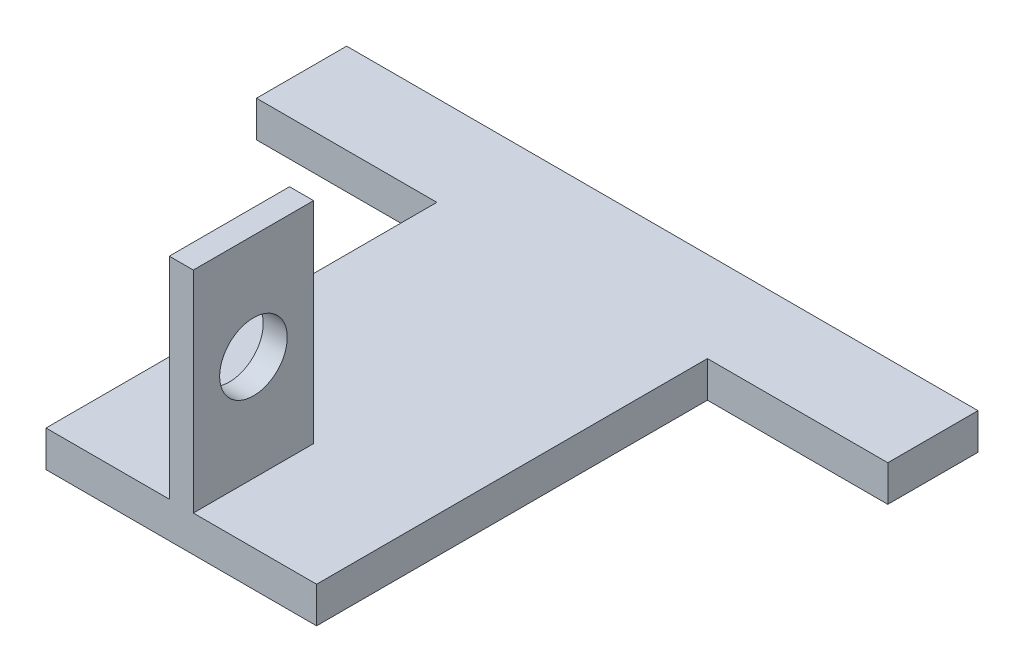
ISO-10303-21;
HEADER;
FILE_DESCRIPTION(('STEP AP214'),'2;1');
FILE_NAME('part.step','',(''),(''),'','','');
FILE_SCHEMA(('AUTOMOTIVE_DESIGN { 1 0 10303 214 1 1 1 1 }'));
ENDSEC;
DATA;
#1=APPLICATION_CONTEXT('core data for automotive mechanical design processes');
#2=APPLICATION_PROTOCOL_DEFINITION('international standard','automotive_design',2000,#1);
#3=PRODUCT_CONTEXT('',#1,'mechanical');
#4=PRODUCT('Part','Part','',(#3));
#5=PRODUCT_RELATED_PRODUCT_CATEGORY('part','',(#4));
#6=PRODUCT_DEFINITION_FORMATION('','',#4);
#7=PRODUCT_DEFINITION_CONTEXT('part definition',#1,'design');
#8=PRODUCT_DEFINITION('design','',#6,#7);
#9=PRODUCT_DEFINITION_SHAPE('','',#8);
#10=(LENGTH_UNIT() NAMED_UNIT(*) SI_UNIT(.MILLI.,.METRE.));
#11=(NAMED_UNIT(*) PLANE_ANGLE_UNIT() SI_UNIT($,.RADIAN.));
#12=(NAMED_UNIT(*) SI_UNIT($,.STERADIAN.) SOLID_ANGLE_UNIT());
#13=UNCERTAINTY_MEASURE_WITH_UNIT(LENGTH_MEASURE(1.E-05),#10,'distance_accuracy_value','');
#14=(GEOMETRIC_REPRESENTATION_CONTEXT(3) GLOBAL_UNCERTAINTY_ASSIGNED_CONTEXT((#13)) GLOBAL_UNIT_ASSIGNED_CONTEXT((#10,
#11,#12)) REPRESENTATION_CONTEXT('',''));
#15=CARTESIAN_POINT('',(0.,0.,0.));
#16=DIRECTION('',(0.,0.,1.));
#17=DIRECTION('',(1.,0.,0.));
#18=AXIS2_PLACEMENT_3D('',#15,#16,#17);
#19=CARTESIAN_POINT('',(0.,2.4,16.));
#20=DIRECTION('',(0.,0.,-1.));
#21=DIRECTION('',(-1.,0.,0.));
#22=AXIS2_PLACEMENT_3D('',#19,#20,#21);
#23=PLANE('',#22);
#24=DIRECTION('',(1.,0.,0.));
#25=VECTOR('',#24,1.);
#26=CARTESIAN_POINT('',(0.,0.,16.));
#27=LINE('',#26,#25);
#28=CARTESIAN_POINT('',(-9.,0.,16.));
#29=VERTEX_POINT('',#28);
#30=CARTESIAN_POINT('',(9.,0.,16.));
#31=VERTEX_POINT('',#30);
#32=EDGE_CURVE('E141',#29,#31,#27,.T.);
#33=ORIENTED_EDGE('',*,*,#32,.T.);
#34=DIRECTION('',(0.,-1.,0.));
#35=VECTOR('',#34,1.);
#36=CARTESIAN_POINT('',(9.,2.4,16.));
#37=LINE('',#36,#35);
#38=CARTESIAN_POINT('',(9.,2.4,16.));
#39=VERTEX_POINT('',#38);
#40=EDGE_CURVE('E11',#39,#31,#37,.T.);
#41=ORIENTED_EDGE('',*,*,#40,.F.);
#42=DIRECTION('',(1.,0.,0.));
#43=VECTOR('',#42,1.);
#44=CARTESIAN_POINT('',(0.,2.4,16.));
#45=LINE('',#44,#43);
#46=CARTESIAN_POINT('',(0.800000000000002,2.4,16.));
#47=VERTEX_POINT('',#46);
#48=EDGE_CURVE('E153',#47,#39,#45,.T.);
#49=ORIENTED_EDGE('',*,*,#48,.F.);
#50=DIRECTION('',(0.,-1.,0.));
#51=VECTOR('',#50,1.);
#52=CARTESIAN_POINT('',(0.800000000000002,16.4,16.));
#53=LINE('',#52,#51);
#54=CARTESIAN_POINT('',(0.800000000000002,16.4,16.));
#55=VERTEX_POINT('',#54);
#56=EDGE_CURVE('E245',#55,#47,#53,.T.);
#57=ORIENTED_EDGE('',*,*,#56,.F.);
#58=DIRECTION('',(1.,0.,0.));
#59=VECTOR('',#58,1.);
#60=CARTESIAN_POINT('',(-0.799999999999998,16.4,16.));
#61=LINE('',#60,#59);
#62=CARTESIAN_POINT('',(-0.799999999999998,16.4,16.));
#63=VERTEX_POINT('',#62);
#64=EDGE_CURVE('E134',#63,#55,#61,.T.);
#65=ORIENTED_EDGE('',*,*,#64,.F.);
#66=DIRECTION('',(0.,-1.,0.));
#67=VECTOR('',#66,1.);
#68=CARTESIAN_POINT('',(-0.799999999999998,16.4,16.));
#69=LINE('',#68,#67);
#70=CARTESIAN_POINT('',(-0.799999999999999,2.4,16.));
#71=VERTEX_POINT('',#70);
#72=EDGE_CURVE('E146',#63,#71,#69,.T.);
#73=ORIENTED_EDGE('',*,*,#72,.T.);
#74=CARTESIAN_POINT('',(-9.,2.4,16.));
#75=VERTEX_POINT('',#74);
#76=EDGE_CURVE('E150',#75,#71,#45,.T.);
#77=ORIENTED_EDGE('',*,*,#76,.F.);
#78=DIRECTION('',(0.,-1.,0.));
#79=VECTOR('',#78,1.);
#80=CARTESIAN_POINT('',(-9.,2.4,16.));
#81=LINE('',#80,#79);
#82=EDGE_CURVE('E170',#75,#29,#81,.T.);
#83=ORIENTED_EDGE('',*,*,#82,.T.);
#84=EDGE_LOOP('',(#33,#41,#49,#57,#65,#73,#77,#83));
#85=FACE_BOUND('',#84,.T.);
#86=ADVANCED_FACE('F33',(#85),#23,.F.);
#87=CARTESIAN_POINT('',(9.,2.4,0.));
#88=DIRECTION('',(-1.,0.,0.));
#89=DIRECTION('',(0.,0.,1.));
#90=AXIS2_PLACEMENT_3D('',#87,#88,#89);
#91=PLANE('',#90);
#92=DIRECTION('',(0.,0.,-1.));
#93=VECTOR('',#92,1.);
#94=CARTESIAN_POINT('',(9.,0.,0.));
#95=LINE('',#94,#93);
#96=CARTESIAN_POINT('',(9.,0.,-10.));
#97=VERTEX_POINT('',#96);
#98=EDGE_CURVE('E144',#31,#97,#95,.T.);
#99=ORIENTED_EDGE('',*,*,#98,.T.);
#100=DIRECTION('',(0.,-1.,0.));
#101=VECTOR('',#100,1.);
#102=CARTESIAN_POINT('',(9.,2.4,-10.));
#103=LINE('',#102,#101);
#104=CARTESIAN_POINT('',(9.,2.4,-10.));
#105=VERTEX_POINT('',#104);
#106=EDGE_CURVE('E40',#105,#97,#103,.T.);
#107=ORIENTED_EDGE('',*,*,#106,.F.);
#108=DIRECTION('',(0.,0.,-1.));
#109=VECTOR('',#108,1.);
#110=CARTESIAN_POINT('',(9.,2.4,0.));
#111=LINE('',#110,#109);
#112=EDGE_CURVE('E152',#39,#105,#111,.T.);
#113=ORIENTED_EDGE('',*,*,#112,.F.);
#114=ORIENTED_EDGE('',*,*,#40,.T.);
#115=EDGE_LOOP('',(#99,#107,#113,#114));
#116=FACE_BOUND('',#115,.T.);
#117=ADVANCED_FACE('F269',(#116),#91,.F.);
#118=CARTESIAN_POINT('',(0.,2.4,-10.));
#119=DIRECTION('',(0.,0.,-1.));
#120=DIRECTION('',(-1.,0.,0.));
#121=AXIS2_PLACEMENT_3D('',#118,#119,#120);
#122=PLANE('',#121);
#123=DIRECTION('',(1.,0.,0.));
#124=VECTOR('',#123,1.);
#125=CARTESIAN_POINT('',(0.,0.,-10.));
#126=LINE('',#125,#124);
#127=CARTESIAN_POINT('',(21.,0.,-10.));
#128=VERTEX_POINT('',#127);
#129=EDGE_CURVE('E173',#97,#128,#126,.T.);
#130=ORIENTED_EDGE('',*,*,#129,.T.);
#131=DIRECTION('',(0.,-1.,0.));
#132=VECTOR('',#131,1.);
#133=CARTESIAN_POINT('',(21.,2.4,-10.));
#134=LINE('',#133,#132);
#135=CARTESIAN_POINT('',(21.,2.4,-10.));
#136=VERTEX_POINT('',#135);
#137=EDGE_CURVE('E200',#136,#128,#134,.T.);
#138=ORIENTED_EDGE('',*,*,#137,.F.);
#139=DIRECTION('',(1.,0.,0.));
#140=VECTOR('',#139,1.);
#141=CARTESIAN_POINT('',(0.,2.4,-10.));
#142=LINE('',#141,#140);
#143=EDGE_CURVE('E155',#105,#136,#142,.T.);
#144=ORIENTED_EDGE('',*,*,#143,.F.);
#145=ORIENTED_EDGE('',*,*,#106,.T.);
#146=EDGE_LOOP('',(#130,#138,#144,#145));
#147=FACE_BOUND('',#146,.T.);
#148=ADVANCED_FACE('F206',(#147),#122,.F.);
#149=CARTESIAN_POINT('',(21.,2.4,0.));
#150=DIRECTION('',(1.,0.,0.));
#151=DIRECTION('',(0.,0.,-1.));
#152=AXIS2_PLACEMENT_3D('',#149,#150,#151);
#153=PLANE('',#152);
#154=DIRECTION('',(0.,0.,1.));
#155=VECTOR('',#154,1.);
#156=CARTESIAN_POINT('',(21.,0.,0.));
#157=LINE('',#156,#155);
#158=CARTESIAN_POINT('',(21.,0.,-16.));
#159=VERTEX_POINT('',#158);
#160=EDGE_CURVE('E176',#159,#128,#157,.T.);
#161=ORIENTED_EDGE('',*,*,#160,.F.);
#162=DIRECTION('',(0.,-1.,0.));
#163=VECTOR('',#162,1.);
#164=CARTESIAN_POINT('',(21.,2.4,-16.));
#165=LINE('',#164,#163);
#166=CARTESIAN_POINT('',(21.,2.4,-16.));
#167=VERTEX_POINT('',#166);
#168=EDGE_CURVE('E198',#167,#159,#165,.T.);
#169=ORIENTED_EDGE('',*,*,#168,.F.);
#170=DIRECTION('',(0.,0.,1.));
#171=VECTOR('',#170,1.);
#172=CARTESIAN_POINT('',(21.,2.4,0.));
#173=LINE('',#172,#171);
#174=EDGE_CURVE('E157',#167,#136,#173,.T.);
#175=ORIENTED_EDGE('',*,*,#174,.T.);
#176=ORIENTED_EDGE('',*,*,#137,.T.);
#177=EDGE_LOOP('',(#161,#169,#175,#176));
#178=FACE_BOUND('',#177,.T.);
#179=ADVANCED_FACE('F217',(#178),#153,.T.);
#180=CARTESIAN_POINT('',(0.,2.4,-16.));
#181=DIRECTION('',(0.,0.,-1.));
#182=DIRECTION('',(-1.,0.,0.));
#183=AXIS2_PLACEMENT_3D('',#180,#181,#182);
#184=PLANE('',#183);
#185=DIRECTION('',(1.,0.,0.));
#186=VECTOR('',#185,1.);
#187=CARTESIAN_POINT('',(0.,0.,-16.));
#188=LINE('',#187,#186);
#189=CARTESIAN_POINT('',(-21.,0.,-16.));
#190=VERTEX_POINT('',#189);
#191=EDGE_CURVE('E179',#190,#159,#188,.T.);
#192=ORIENTED_EDGE('',*,*,#191,.F.);
#193=DIRECTION('',(0.,-1.,0.));
#194=VECTOR('',#193,1.);
#195=CARTESIAN_POINT('',(-21.,2.4,-16.));
#196=LINE('',#195,#194);
#197=CARTESIAN_POINT('',(-21.,2.4,-16.));
#198=VERTEX_POINT('',#197);
#199=EDGE_CURVE('E196',#198,#190,#196,.T.);
#200=ORIENTED_EDGE('',*,*,#199,.F.);
#201=DIRECTION('',(1.,0.,0.));
#202=VECTOR('',#201,1.);
#203=CARTESIAN_POINT('',(0.,2.4,-16.));
#204=LINE('',#203,#202);
#205=EDGE_CURVE('E160',#198,#167,#204,.T.);
#206=ORIENTED_EDGE('',*,*,#205,.T.);
#207=ORIENTED_EDGE('',*,*,#168,.T.);
#208=EDGE_LOOP('',(#192,#200,#206,#207));
#209=FACE_BOUND('',#208,.T.);
#210=ADVANCED_FACE('F222',(#209),#184,.T.);
#211=CARTESIAN_POINT('',(-21.,2.4,0.));
#212=DIRECTION('',(1.,0.,0.));
#213=DIRECTION('',(0.,0.,-1.));
#214=AXIS2_PLACEMENT_3D('',#211,#212,#213);
#215=PLANE('',#214);
#216=DIRECTION('',(0.,0.,1.));
#217=VECTOR('',#216,1.);
#218=CARTESIAN_POINT('',(-21.,0.,0.));
#219=LINE('',#218,#217);
#220=CARTESIAN_POINT('',(-21.,0.,-10.));
#221=VERTEX_POINT('',#220);
#222=EDGE_CURVE('E182',#190,#221,#219,.T.);
#223=ORIENTED_EDGE('',*,*,#222,.T.);
#224=DIRECTION('',(0.,-1.,0.));
#225=VECTOR('',#224,1.);
#226=CARTESIAN_POINT('',(-21.,2.4,-10.));
#227=LINE('',#226,#225);
#228=CARTESIAN_POINT('',(-21.,2.4,-10.));
#229=VERTEX_POINT('',#228);
#230=EDGE_CURVE('E194',#229,#221,#227,.T.);
#231=ORIENTED_EDGE('',*,*,#230,.F.);
#232=DIRECTION('',(0.,0.,1.));
#233=VECTOR('',#232,1.);
#234=CARTESIAN_POINT('',(-21.,2.4,0.));
#235=LINE('',#234,#233);
#236=EDGE_CURVE('E163',#198,#229,#235,.T.);
#237=ORIENTED_EDGE('',*,*,#236,.F.);
#238=ORIENTED_EDGE('',*,*,#199,.T.);
#239=EDGE_LOOP('',(#223,#231,#237,#238));
#240=FACE_BOUND('',#239,.T.);
#241=ADVANCED_FACE('F226',(#240),#215,.F.);
#242=CARTESIAN_POINT('',(0.,2.4,-10.));
#243=DIRECTION('',(0.,0.,1.));
#244=DIRECTION('',(1.,0.,0.));
#245=AXIS2_PLACEMENT_3D('',#242,#243,#244);
#246=PLANE('',#245);
#247=DIRECTION('',(-1.,0.,0.));
#248=VECTOR('',#247,1.);
#249=CARTESIAN_POINT('',(0.,0.,-10.));
#250=LINE('',#249,#248);
#251=CARTESIAN_POINT('',(-9.,0.,-10.));
#252=VERTEX_POINT('',#251);
#253=EDGE_CURVE('E185',#252,#221,#250,.T.);
#254=ORIENTED_EDGE('',*,*,#253,.F.);
#255=DIRECTION('',(0.,-1.,0.));
#256=VECTOR('',#255,1.);
#257=CARTESIAN_POINT('',(-9.,2.4,-10.));
#258=LINE('',#257,#256);
#259=CARTESIAN_POINT('',(-9.,2.4,-10.));
#260=VERTEX_POINT('',#259);
#261=EDGE_CURVE('E192',#260,#252,#258,.T.);
#262=ORIENTED_EDGE('',*,*,#261,.F.);
#263=DIRECTION('',(-1.,0.,0.));
#264=VECTOR('',#263,1.);
#265=CARTESIAN_POINT('',(0.,2.4,-10.));
#266=LINE('',#265,#264);
#267=EDGE_CURVE('E165',#260,#229,#266,.T.);
#268=ORIENTED_EDGE('',*,*,#267,.T.);
#269=ORIENTED_EDGE('',*,*,#230,.T.);
#270=EDGE_LOOP('',(#254,#262,#268,#269));
#271=FACE_BOUND('',#270,.T.);
#272=ADVANCED_FACE('F284',(#271),#246,.T.);
#273=CARTESIAN_POINT('',(-9.,2.4,0.));
#274=DIRECTION('',(-1.,0.,0.));
#275=DIRECTION('',(0.,0.,1.));
#276=AXIS2_PLACEMENT_3D('',#273,#274,#275);
#277=PLANE('',#276);
#278=DIRECTION('',(0.,0.,-1.));
#279=VECTOR('',#278,1.);
#280=CARTESIAN_POINT('',(-9.,0.,0.));
#281=LINE('',#280,#279);
#282=EDGE_CURVE('E188',#29,#252,#281,.T.);
#283=ORIENTED_EDGE('',*,*,#282,.F.);
#284=ORIENTED_EDGE('',*,*,#82,.F.);
#285=DIRECTION('',(0.,0.,-1.));
#286=VECTOR('',#285,1.);
#287=CARTESIAN_POINT('',(-9.,2.4,0.));
#288=LINE('',#287,#286);
#289=EDGE_CURVE('E168',#75,#260,#288,.T.);
#290=ORIENTED_EDGE('',*,*,#289,.T.);
#291=ORIENTED_EDGE('',*,*,#261,.T.);
#292=EDGE_LOOP('',(#283,#284,#290,#291));
#293=FACE_BOUND('',#292,.T.);
#294=ADVANCED_FACE('F232',(#293),#277,.T.);
#295=CARTESIAN_POINT('',(0.,2.4,0.));
#296=DIRECTION('',(0.,1.,0.));
#297=DIRECTION('',(0.,0.,1.));
#298=AXIS2_PLACEMENT_3D('',#295,#296,#297);
#299=PLANE('',#298);
#300=DIRECTION('',(0.,0.,-1.));
#301=VECTOR('',#300,1.);
#302=CARTESIAN_POINT('',(0.800000000000001,2.4,8.));
#303=LINE('',#302,#301);
#304=CARTESIAN_POINT('',(0.800000000000001,2.4,8.));
#305=VERTEX_POINT('',#304);
#306=EDGE_CURVE('E52',#47,#305,#303,.T.);
#307=ORIENTED_EDGE('',*,*,#306,.F.);
#308=ORIENTED_EDGE('',*,*,#48,.T.);
#309=ORIENTED_EDGE('',*,*,#112,.T.);
#310=ORIENTED_EDGE('',*,*,#143,.T.);
#311=ORIENTED_EDGE('',*,*,#174,.F.);
#312=ORIENTED_EDGE('',*,*,#205,.F.);
#313=ORIENTED_EDGE('',*,*,#236,.T.);
#314=ORIENTED_EDGE('',*,*,#267,.F.);
#315=ORIENTED_EDGE('',*,*,#289,.F.);
#316=ORIENTED_EDGE('',*,*,#76,.T.);
#317=DIRECTION('',(0.,0.,1.));
#318=VECTOR('',#317,1.);
#319=CARTESIAN_POINT('',(-0.799999999999999,2.4,8.));
#320=LINE('',#319,#318);
#321=CARTESIAN_POINT('',(-0.799999999999999,2.4,8.));
#322=VERTEX_POINT('',#321);
#323=EDGE_CURVE('E138',#322,#71,#320,.T.);
#324=ORIENTED_EDGE('',*,*,#323,.F.);
#325=DIRECTION('',(-1.,0.,0.));
#326=VECTOR('',#325,1.);
#327=CARTESIAN_POINT('',(-0.799999999999999,2.4,8.));
#328=LINE('',#327,#326);
#329=EDGE_CURVE('E47',#305,#322,#328,.T.);
#330=ORIENTED_EDGE('',*,*,#329,.F.);
#331=EDGE_LOOP('',(#307,#308,#309,#310,#311,#312,#313,#314,#315,#316,#324,#330));
#332=FACE_BOUND('',#331,.T.);
#333=ADVANCED_FACE('F220',(#332),#299,.T.);
#334=CARTESIAN_POINT('',(0.,0.,0.));
#335=DIRECTION('',(0.,1.,0.));
#336=DIRECTION('',(0.,0.,1.));
#337=AXIS2_PLACEMENT_3D('',#334,#335,#336);
#338=PLANE('',#337);
#339=ORIENTED_EDGE('',*,*,#32,.F.);
#340=ORIENTED_EDGE('',*,*,#282,.T.);
#341=ORIENTED_EDGE('',*,*,#253,.T.);
#342=ORIENTED_EDGE('',*,*,#222,.F.);
#343=ORIENTED_EDGE('',*,*,#191,.T.);
#344=ORIENTED_EDGE('',*,*,#160,.T.);
#345=ORIENTED_EDGE('',*,*,#129,.F.);
#346=ORIENTED_EDGE('',*,*,#98,.F.);
#347=EDGE_LOOP('',(#339,#340,#341,#342,#343,#344,#345,#346));
#348=FACE_BOUND('',#347,.T.);
#349=ADVANCED_FACE('F212',(#348),#338,.F.);
#350=CARTESIAN_POINT('',(0.800000000000001,16.4,8.));
#351=DIRECTION('',(-1.,0.,0.));
#352=DIRECTION('',(0.,0.,1.));
#353=AXIS2_PLACEMENT_3D('',#350,#351,#352);
#354=PLANE('',#353);
#355=CARTESIAN_POINT('',(0.800000000000002,9.4,12.));
#356=DIRECTION('',(-1.,0.,0.));
#357=DIRECTION('',(0.,0.,1.));
#358=AXIS2_PLACEMENT_3D('',#355,#356,#357);
#359=CIRCLE('',#358,2.25);
#360=CARTESIAN_POINT('',(0.800000000000002,9.4,14.25));
#361=VERTEX_POINT('',#360);
#362=EDGE_CURVE('E248',#361,#361,#359,.F.);
#363=ORIENTED_EDGE('',*,*,#362,.F.);
#364=EDGE_LOOP('',(#363));
#365=FACE_BOUND('',#364,.T.);
#366=ORIENTED_EDGE('',*,*,#306,.T.);
#367=DIRECTION('',(0.,-1.,0.));
#368=VECTOR('',#367,1.);
#369=CARTESIAN_POINT('',(0.800000000000001,16.4,8.));
#370=LINE('',#369,#368);
#371=CARTESIAN_POINT('',(0.800000000000001,16.4,8.));
#372=VERTEX_POINT('',#371);
#373=EDGE_CURVE('E123',#372,#305,#370,.T.);
#374=ORIENTED_EDGE('',*,*,#373,.F.);
#375=DIRECTION('',(0.,0.,-1.));
#376=VECTOR('',#375,1.);
#377=CARTESIAN_POINT('',(0.800000000000001,16.4,8.));
#378=LINE('',#377,#376);
#379=EDGE_CURVE('E129',#55,#372,#378,.T.);
#380=ORIENTED_EDGE('',*,*,#379,.F.);
#381=ORIENTED_EDGE('',*,*,#56,.T.);
#382=EDGE_LOOP('',(#366,#374,#380,#381));
#383=FACE_BOUND('',#382,.T.);
#384=ADVANCED_FACE('F140',(#365,#383),#354,.F.);
#385=CARTESIAN_POINT('',(-0.799999999999999,16.4,8.));
#386=DIRECTION('',(0.,0.,1.));
#387=DIRECTION('',(1.,0.,0.));
#388=AXIS2_PLACEMENT_3D('',#385,#386,#387);
#389=PLANE('',#388);
#390=ORIENTED_EDGE('',*,*,#329,.T.);
#391=DIRECTION('',(0.,-1.,0.));
#392=VECTOR('',#391,1.);
#393=CARTESIAN_POINT('',(-0.799999999999999,16.4,8.));
#394=LINE('',#393,#392);
#395=CARTESIAN_POINT('',(-0.799999999999999,16.4,8.));
#396=VERTEX_POINT('',#395);
#397=EDGE_CURVE('E125',#396,#322,#394,.T.);
#398=ORIENTED_EDGE('',*,*,#397,.F.);
#399=DIRECTION('',(-1.,0.,0.));
#400=VECTOR('',#399,1.);
#401=CARTESIAN_POINT('',(-0.799999999999999,16.4,8.));
#402=LINE('',#401,#400);
#403=EDGE_CURVE('E119',#372,#396,#402,.T.);
#404=ORIENTED_EDGE('',*,*,#403,.F.);
#405=ORIENTED_EDGE('',*,*,#373,.T.);
#406=EDGE_LOOP('',(#390,#398,#404,#405));
#407=FACE_BOUND('',#406,.T.);
#408=ADVANCED_FACE('F121',(#407),#389,.F.);
#409=CARTESIAN_POINT('',(-0.799999999999999,16.4,8.));
#410=DIRECTION('',(1.,0.,0.));
#411=DIRECTION('',(0.,0.,-1.));
#412=AXIS2_PLACEMENT_3D('',#409,#410,#411);
#413=PLANE('',#412);
#414=CARTESIAN_POINT('',(-0.799999999999999,9.4,12.));
#415=DIRECTION('',(-1.,0.,0.));
#416=DIRECTION('',(0.,0.,1.));
#417=AXIS2_PLACEMENT_3D('',#414,#415,#416);
#418=CIRCLE('',#417,2.25);
#419=CARTESIAN_POINT('',(-0.799999999999998,9.4,14.25));
#420=VERTEX_POINT('',#419);
#421=EDGE_CURVE('E250',#420,#420,#418,.T.);
#422=ORIENTED_EDGE('',*,*,#421,.F.);
#423=EDGE_LOOP('',(#422));
#424=FACE_BOUND('',#423,.T.);
#425=ORIENTED_EDGE('',*,*,#323,.T.);
#426=ORIENTED_EDGE('',*,*,#72,.F.);
#427=DIRECTION('',(0.,0.,1.));
#428=VECTOR('',#427,1.);
#429=CARTESIAN_POINT('',(-0.799999999999999,16.4,8.));
#430=LINE('',#429,#428);
#431=EDGE_CURVE('E128',#396,#63,#430,.T.);
#432=ORIENTED_EDGE('',*,*,#431,.F.);
#433=ORIENTED_EDGE('',*,*,#397,.T.);
#434=EDGE_LOOP('',(#425,#426,#432,#433));
#435=FACE_BOUND('',#434,.T.);
#436=ADVANCED_FACE('F240',(#424,#435),#413,.F.);
#437=CARTESIAN_POINT('',(0.,16.4,0.));
#438=DIRECTION('',(0.,1.,0.));
#439=DIRECTION('',(0.,0.,1.));
#440=AXIS2_PLACEMENT_3D('',#437,#438,#439);
#441=PLANE('',#440);
#442=ORIENTED_EDGE('',*,*,#379,.T.);
#443=ORIENTED_EDGE('',*,*,#403,.T.);
#444=ORIENTED_EDGE('',*,*,#431,.T.);
#445=ORIENTED_EDGE('',*,*,#64,.T.);
#446=EDGE_LOOP('',(#442,#443,#444,#445));
#447=FACE_BOUND('',#446,.T.);
#448=ADVANCED_FACE('F132',(#447),#441,.T.);
#449=CARTESIAN_POINT('',(21.001,9.4,12.));
#450=DIRECTION('',(-1.,0.,0.));
#451=DIRECTION('',(0.,0.,1.));
#452=AXIS2_PLACEMENT_3D('',#449,#450,#451);
#453=CYLINDRICAL_SURFACE('',#452,2.25);
#454=ORIENTED_EDGE('',*,*,#421,.T.);
#455=EDGE_LOOP('',(#454));
#456=FACE_BOUND('',#455,.T.);
#457=ORIENTED_EDGE('',*,*,#362,.T.);
#458=EDGE_LOOP('',(#457));
#459=FACE_BOUND('',#458,.T.);
#460=ADVANCED_FACE('F258',(#456,#459),#453,.F.);
#461=CLOSED_SHELL('',(#86,#117,#148,#179,#210,#241,#272,#294,#333,#349,#384,#408,#436,#448,#460));
#462=MANIFOLD_SOLID_BREP('B2',#461);
#463=ADVANCED_BREP_SHAPE_REPRESENTATION('',(#18,#462),#14);
#464=SHAPE_DEFINITION_REPRESENTATION(#9,#463);
ENDSEC;
END-ISO-10303-21;
